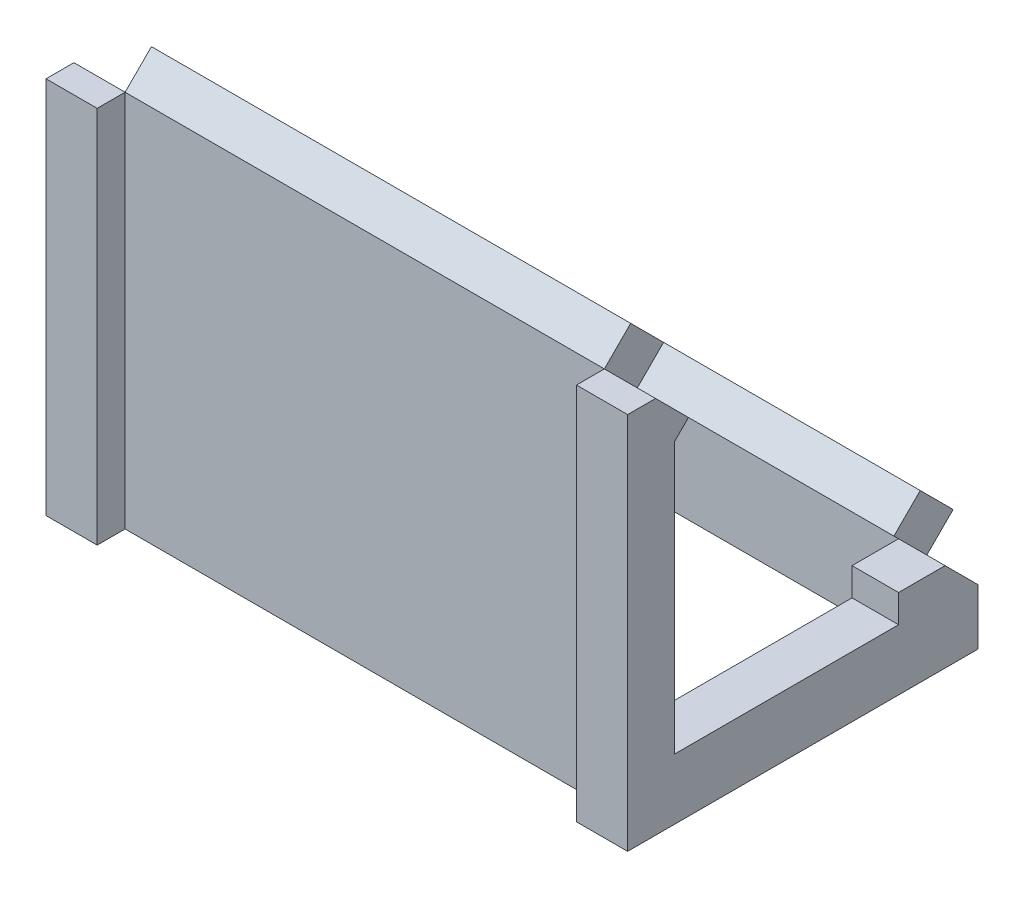
ISO-10303-21;
HEADER;
FILE_DESCRIPTION(('STEP AP214'),'2;1');
FILE_NAME('part.step','',(''),(''),'','','');
FILE_SCHEMA(('AUTOMOTIVE_DESIGN { 1 0 10303 214 1 1 1 1 }'));
ENDSEC;
DATA;
#1=APPLICATION_CONTEXT('core data for automotive mechanical design processes');
#2=APPLICATION_PROTOCOL_DEFINITION('international standard','automotive_design',2000,#1);
#3=PRODUCT_CONTEXT('',#1,'mechanical');
#4=PRODUCT('Part','Part','',(#3));
#5=PRODUCT_RELATED_PRODUCT_CATEGORY('part','',(#4));
#6=PRODUCT_DEFINITION_FORMATION('','',#4);
#7=PRODUCT_DEFINITION_CONTEXT('part definition',#1,'design');
#8=PRODUCT_DEFINITION('design','',#6,#7);
#9=PRODUCT_DEFINITION_SHAPE('','',#8);
#10=(LENGTH_UNIT() NAMED_UNIT(*) SI_UNIT(.MILLI.,.METRE.));
#11=(NAMED_UNIT(*) PLANE_ANGLE_UNIT() SI_UNIT($,.RADIAN.));
#12=(NAMED_UNIT(*) SI_UNIT($,.STERADIAN.) SOLID_ANGLE_UNIT());
#13=UNCERTAINTY_MEASURE_WITH_UNIT(LENGTH_MEASURE(1.E-05),#10,'distance_accuracy_value','');
#14=(GEOMETRIC_REPRESENTATION_CONTEXT(3) GLOBAL_UNCERTAINTY_ASSIGNED_CONTEXT((#13)) GLOBAL_UNIT_ASSIGNED_CONTEXT((#10,
#11,#12)) REPRESENTATION_CONTEXT('',''));
#15=CARTESIAN_POINT('',(0.,0.,0.));
#16=DIRECTION('',(0.,0.,1.));
#17=DIRECTION('',(1.,0.,0.));
#18=AXIS2_PLACEMENT_3D('',#15,#16,#17);
#19=CARTESIAN_POINT('',(0.,12.7279220613579,-67.8822509939089));
#20=DIRECTION('',(0.,-0.707106781186544,-0.707106781186552));
#21=DIRECTION('',(0.,0.707106781186552,-0.707106781186544));
#22=AXIS2_PLACEMENT_3D('',#19,#20,#21);
#23=PLANE('',#22);
#24=DIRECTION('',(0.,-0.70710678118655,0.707106781186545));
#25=VECTOR('',#24,1.);
#26=CARTESIAN_POINT('',(-114.,12.7279220613579,-67.8822509939089));
#27=LINE('',#26,#25);
#28=CARTESIAN_POINT('',(-114.,12.7279220613579,-67.8822509939089));
#29=VERTEX_POINT('',#28);
#30=CARTESIAN_POINT('',(-114.,7.07106781186547,-62.2253967444165));
#31=VERTEX_POINT('',#30);
#32=EDGE_CURVE('E470',#29,#31,#27,.T.);
#33=ORIENTED_EDGE('',*,*,#32,.T.);
#34=DIRECTION('',(1.,0.,0.));
#35=VECTOR('',#34,1.);
#36=CARTESIAN_POINT('',(0.,7.07106781186546,-62.2253967444165));
#37=LINE('',#36,#35);
#38=CARTESIAN_POINT('',(-11.,7.07106781186547,-62.2253967444165));
#39=VERTEX_POINT('',#38);
#40=EDGE_CURVE('E305',#31,#39,#37,.T.);
#41=ORIENTED_EDGE('',*,*,#40,.T.);
#42=DIRECTION('',(0.,-0.70710678118655,0.707106781186545));
#43=VECTOR('',#42,1.);
#44=CARTESIAN_POINT('',(-11.,12.7279220613579,-67.8822509939089));
#45=LINE('',#44,#43);
#46=CARTESIAN_POINT('',(-11.,12.7279220613579,-67.8822509939089));
#47=VERTEX_POINT('',#46);
#48=EDGE_CURVE('E443',#47,#39,#45,.T.);
#49=ORIENTED_EDGE('',*,*,#48,.F.);
#50=DIRECTION('',(1.,0.,0.));
#51=VECTOR('',#50,1.);
#52=CARTESIAN_POINT('',(0.,12.7279220613579,-67.8822509939089));
#53=LINE('',#52,#51);
#54=EDGE_CURVE('E300',#29,#47,#53,.T.);
#55=ORIENTED_EDGE('',*,*,#54,.F.);
#56=EDGE_LOOP('',(#33,#41,#49,#55));
#57=FACE_BOUND('',#56,.T.);
#58=ADVANCED_FACE('F41',(#57),#23,.F.);
#59=CARTESIAN_POINT('',(0.,5.65685424949243,-74.9533188057744));
#60=DIRECTION('',(0.,0.707106781186544,0.707106781186552));
#61=DIRECTION('',(0.,-0.707106781186552,0.707106781186544));
#62=AXIS2_PLACEMENT_3D('',#59,#60,#61);
#63=PLANE('',#62);
#64=DIRECTION('',(0.,0.707106781186552,-0.707106781186543));
#65=VECTOR('',#64,1.);
#66=CARTESIAN_POINT('',(-114.,0.,-69.2964645562821));
#67=LINE('',#66,#65);
#68=CARTESIAN_POINT('',(-114.,0.,-69.2964645562821));
#69=VERTEX_POINT('',#68);
#70=CARTESIAN_POINT('',(-114.,5.65685424949243,-74.9533188057744));
#71=VERTEX_POINT('',#70);
#72=EDGE_CURVE('E462',#69,#71,#67,.T.);
#73=ORIENTED_EDGE('',*,*,#72,.T.);
#74=DIRECTION('',(-1.,0.,0.));
#75=VECTOR('',#74,1.);
#76=CARTESIAN_POINT('',(0.,5.65685424949243,-74.9533188057744));
#77=LINE('',#76,#75);
#78=CARTESIAN_POINT('',(-11.,5.65685424949243,-74.9533188057744));
#79=VERTEX_POINT('',#78);
#80=EDGE_CURVE('E252',#79,#71,#77,.T.);
#81=ORIENTED_EDGE('',*,*,#80,.F.);
#82=DIRECTION('',(0.,0.707106781186552,-0.707106781186543));
#83=VECTOR('',#82,1.);
#84=CARTESIAN_POINT('',(-11.,0.,-69.2964645562821));
#85=LINE('',#84,#83);
#86=CARTESIAN_POINT('',(-11.,0.,-69.2964645562821));
#87=VERTEX_POINT('',#86);
#88=EDGE_CURVE('E66',#87,#79,#85,.T.);
#89=ORIENTED_EDGE('',*,*,#88,.F.);
#90=DIRECTION('',(-1.,0.,0.));
#91=VECTOR('',#90,1.);
#92=CARTESIAN_POINT('',(0.,0.,-69.2964645562821));
#93=LINE('',#92,#91);
#94=EDGE_CURVE('E296',#87,#69,#93,.T.);
#95=ORIENTED_EDGE('',*,*,#94,.T.);
#96=EDGE_LOOP('',(#73,#81,#89,#95));
#97=FACE_BOUND('',#96,.T.);
#98=ADVANCED_FACE('F662',(#97),#63,.F.);
#99=CARTESIAN_POINT('',(0.,40.3050865276335,-40.305086527633));
#100=DIRECTION('',(0.,0.707106781186551,-0.707106781186544));
#101=DIRECTION('',(0.,0.707106781186544,0.707106781186551));
#102=AXIS2_PLACEMENT_3D('',#99,#100,#101);
#103=PLANE('',#102);
#104=ORIENTED_EDGE('',*,*,#80,.T.);
#105=DIRECTION('',(0.,0.707106781186543,0.707106781186552));
#106=VECTOR('',#105,1.);
#107=CARTESIAN_POINT('',(-114.,5.65685424949243,-74.9533188057744));
#108=LINE('',#107,#106);
#109=EDGE_CURVE('E466',#71,#29,#108,.T.);
#110=ORIENTED_EDGE('',*,*,#109,.T.);
#111=ORIENTED_EDGE('',*,*,#54,.T.);
#112=DIRECTION('',(0.,0.707106781186543,0.707106781186552));
#113=VECTOR('',#112,1.);
#114=CARTESIAN_POINT('',(-11.,5.65685424949243,-74.9533188057744));
#115=LINE('',#114,#113);
#116=EDGE_CURVE('E435',#79,#47,#115,.T.);
#117=ORIENTED_EDGE('',*,*,#116,.F.);
#118=EDGE_LOOP('',(#104,#110,#111,#117));
#119=FACE_BOUND('',#118,.T.);
#120=ADVANCED_FACE('F668',(#119),#103,.T.);
#121=CARTESIAN_POINT('',(0.,74.9533188057737,-5.65685424949233));
#122=DIRECTION('',(0.,-0.707106781186544,-0.707106781186552));
#123=DIRECTION('',(0.,0.707106781186552,-0.707106781186544));
#124=AXIS2_PLACEMENT_3D('',#121,#122,#123);
#125=PLANE('',#124);
#126=DIRECTION('',(0.,-0.707106781186553,0.707106781186542));
#127=VECTOR('',#126,1.);
#128=CARTESIAN_POINT('',(-114.,74.9533188057737,-5.65685424949233));
#129=LINE('',#128,#127);
#130=CARTESIAN_POINT('',(-114.,74.9533188057737,-5.65685424949233));
#131=VERTEX_POINT('',#130);
#132=CARTESIAN_POINT('',(-114.,69.2964645562813,0.));
#133=VERTEX_POINT('',#132);
#134=EDGE_CURVE('E454',#131,#133,#129,.T.);
#135=ORIENTED_EDGE('',*,*,#134,.T.);
#136=DIRECTION('',(1.,0.,0.));
#137=VECTOR('',#136,1.);
#138=CARTESIAN_POINT('',(0.,69.2964645562813,0.));
#139=LINE('',#138,#137);
#140=CARTESIAN_POINT('',(-11.,69.2964645562813,0.));
#141=VERTEX_POINT('',#140);
#142=EDGE_CURVE('E311',#133,#141,#139,.T.);
#143=ORIENTED_EDGE('',*,*,#142,.T.);
#144=DIRECTION('',(0.,-0.707106781186553,0.707106781186542));
#145=VECTOR('',#144,1.);
#146=CARTESIAN_POINT('',(-11.,74.9533188057737,-5.65685424949233));
#147=LINE('',#146,#145);
#148=CARTESIAN_POINT('',(-11.,74.9533188057737,-5.65685424949233));
#149=VERTEX_POINT('',#148);
#150=EDGE_CURVE('E428',#149,#141,#147,.T.);
#151=ORIENTED_EDGE('',*,*,#150,.F.);
#152=DIRECTION('',(1.,0.,0.));
#153=VECTOR('',#152,1.);
#154=CARTESIAN_POINT('',(0.,74.9533188057737,-5.65685424949233));
#155=LINE('',#154,#153);
#156=EDGE_CURVE('E315',#131,#149,#155,.T.);
#157=ORIENTED_EDGE('',*,*,#156,.F.);
#158=EDGE_LOOP('',(#135,#143,#151,#157));
#159=FACE_BOUND('',#158,.T.);
#160=ADVANCED_FACE('F620',(#159),#125,.F.);
#161=CARTESIAN_POINT('',(0.,40.3050865276334,-40.305086527633));
#162=DIRECTION('',(0.,0.707106781186551,-0.707106781186544));
#163=DIRECTION('',(0.,0.707106781186544,0.707106781186551));
#164=AXIS2_PLACEMENT_3D('',#161,#162,#163);
#165=PLANE('',#164);
#166=DIRECTION('',(-1.,0.,0.));
#167=VECTOR('',#166,1.);
#168=CARTESIAN_POINT('',(0.,67.8822509939082,-12.7279220613579));
#169=LINE('',#168,#167);
#170=CARTESIAN_POINT('',(-11.,67.8822509939082,-12.7279220613579));
#171=VERTEX_POINT('',#170);
#172=CARTESIAN_POINT('',(-114.,67.8822509939083,-12.7279220613579));
#173=VERTEX_POINT('',#172);
#174=EDGE_CURVE('E317',#171,#173,#169,.T.);
#175=ORIENTED_EDGE('',*,*,#174,.T.);
#176=DIRECTION('',(0.,0.707106781186543,0.707106781186551));
#177=VECTOR('',#176,1.);
#178=CARTESIAN_POINT('',(-114.,67.8822509939082,-12.7279220613579));
#179=LINE('',#178,#177);
#180=EDGE_CURVE('E58',#173,#131,#179,.T.);
#181=ORIENTED_EDGE('',*,*,#180,.T.);
#182=ORIENTED_EDGE('',*,*,#156,.T.);
#183=DIRECTION('',(0.,0.707106781186543,0.707106781186551));
#184=VECTOR('',#183,1.);
#185=CARTESIAN_POINT('',(-11.,67.8822509939082,-12.7279220613579));
#186=LINE('',#185,#184);
#187=EDGE_CURVE('E417',#171,#149,#186,.T.);
#188=ORIENTED_EDGE('',*,*,#187,.F.);
#189=EDGE_LOOP('',(#175,#181,#182,#188));
#190=FACE_BOUND('',#189,.T.);
#191=ADVANCED_FACE('F708',(#190),#165,.T.);
#192=CARTESIAN_POINT('',(0.,67.8822509939082,-12.7279220613579));
#193=DIRECTION('',(0.,0.707106781186544,0.707106781186552));
#194=DIRECTION('',(0.,-0.707106781186552,0.707106781186544));
#195=AXIS2_PLACEMENT_3D('',#192,#193,#194);
#196=PLANE('',#195);
#197=DIRECTION('',(-1.,0.,0.));
#198=VECTOR('',#197,1.);
#199=CARTESIAN_POINT('',(0.,62.2253967444159,-7.07106781186552));
#200=LINE('',#199,#198);
#201=CARTESIAN_POINT('',(-114.,62.2253967444158,-7.07106781186586));
#202=VERTEX_POINT('',#201);
#203=CARTESIAN_POINT('',(-125.,62.2253967444158,-7.07106781186586));
#204=VERTEX_POINT('',#203);
#205=EDGE_CURVE('E233',#202,#204,#200,.T.);
#206=ORIENTED_EDGE('',*,*,#205,.F.);
#207=DIRECTION('',(0.,0.707106781186574,-0.707106781186522));
#208=VECTOR('',#207,1.);
#209=CARTESIAN_POINT('',(-114.,62.2253967444158,-7.07106781186586));
#210=LINE('',#209,#208);
#211=EDGE_CURVE('E449',#202,#173,#210,.T.);
#212=ORIENTED_EDGE('',*,*,#211,.T.);
#213=ORIENTED_EDGE('',*,*,#174,.F.);
#214=DIRECTION('',(0.,0.707106781186574,-0.707106781186522));
#215=VECTOR('',#214,1.);
#216=CARTESIAN_POINT('',(-11.,62.2253967444158,-7.07106781186586));
#217=LINE('',#216,#215);
#218=CARTESIAN_POINT('',(-11.,62.2253967444158,-7.07106781186586));
#219=VERTEX_POINT('',#218);
#220=EDGE_CURVE('E421',#219,#171,#217,.T.);
#221=ORIENTED_EDGE('',*,*,#220,.F.);
#222=CARTESIAN_POINT('',(0.,62.2253967444158,-7.07106781186586));
#223=VERTEX_POINT('',#222);
#224=EDGE_CURVE('E251',#223,#219,#200,.T.);
#225=ORIENTED_EDGE('',*,*,#224,.F.);
#226=DIRECTION('',(0.,0.7071067811865,-0.707106781186595));
#227=VECTOR('',#226,1.);
#228=CARTESIAN_POINT('',(0.,59.2253967444162,-4.07106781186586));
#229=LINE('',#228,#227);
#230=CARTESIAN_POINT('',(0.,59.2253967444162,-4.07106781186586));
#231=VERTEX_POINT('',#230);
#232=EDGE_CURVE('E560',#231,#223,#229,.T.);
#233=ORIENTED_EDGE('',*,*,#232,.F.);
#234=DIRECTION('',(1.,0.,0.));
#235=VECTOR('',#234,1.);
#236=CARTESIAN_POINT('',(-125.002,59.2253967444162,-4.07106781186586));
#237=LINE('',#236,#235);
#238=CARTESIAN_POINT('',(-125.,59.2253967444162,-4.07106781186586));
#239=VERTEX_POINT('',#238);
#240=EDGE_CURVE('E236',#239,#231,#237,.T.);
#241=ORIENTED_EDGE('',*,*,#240,.F.);
#242=DIRECTION('',(0.,-0.707106781186499,0.707106781186596));
#243=VECTOR('',#242,1.);
#244=CARTESIAN_POINT('',(-125.,59.2253967444162,-4.07106781186586));
#245=LINE('',#244,#243);
#246=EDGE_CURVE('E230',#204,#239,#245,.T.);
#247=ORIENTED_EDGE('',*,*,#246,.F.);
#248=EDGE_LOOP('',(#206,#212,#213,#221,#225,#233,#241,#247));
#249=FACE_BOUND('',#248,.T.);
#250=ADVANCED_FACE('F232',(#249),#196,.F.);
#251=CARTESIAN_POINT('',(0.,-12.,-62.2253967444165));
#252=DIRECTION('',(0.,0.,-1.));
#253=DIRECTION('',(-1.,0.,0.));
#254=AXIS2_PLACEMENT_3D('',#251,#252,#253);
#255=PLANE('',#254);
#256=CARTESIAN_POINT('',(-115.,7.07106781186547,-62.2253967444165));
#257=VERTEX_POINT('',#256);
#258=EDGE_CURVE('E301',#257,#31,#37,.T.);
#259=ORIENTED_EDGE('',*,*,#258,.F.);
#260=DIRECTION('',(0.,1.,0.));
#261=VECTOR('',#260,1.);
#262=CARTESIAN_POINT('',(-115.,-12.,-62.2253967444165));
#263=LINE('',#262,#261);
#264=CARTESIAN_POINT('',(-115.,-12.,-62.2253967444165));
#265=VERTEX_POINT('',#264);
#266=EDGE_CURVE('E323',#265,#257,#263,.T.);
#267=ORIENTED_EDGE('',*,*,#266,.F.);
#268=DIRECTION('',(-1.,0.,0.));
#269=VECTOR('',#268,1.);
#270=CARTESIAN_POINT('',(0.,-12.,-62.2253967444165));
#271=LINE('',#270,#269);
#272=CARTESIAN_POINT('',(-10.,-12.,-62.2253967444165));
#273=VERTEX_POINT('',#272);
#274=EDGE_CURVE('E348',#273,#265,#271,.T.);
#275=ORIENTED_EDGE('',*,*,#274,.F.);
#276=DIRECTION('',(0.,1.,0.));
#277=VECTOR('',#276,1.);
#278=CARTESIAN_POINT('',(-10.,-12.,-62.2253967444165));
#279=LINE('',#278,#277);
#280=CARTESIAN_POINT('',(-10.,7.07106781186547,-62.2253967444165));
#281=VERTEX_POINT('',#280);
#282=EDGE_CURVE('E316',#273,#281,#279,.T.);
#283=ORIENTED_EDGE('',*,*,#282,.T.);
#284=DIRECTION('',(1.,0.,0.));
#285=VECTOR('',#284,1.);
#286=CARTESIAN_POINT('',(-11.,7.07106781186547,-62.2253967444165));
#287=LINE('',#286,#285);
#288=EDGE_CURVE('E432',#39,#281,#287,.T.);
#289=ORIENTED_EDGE('',*,*,#288,.F.);
#290=ORIENTED_EDGE('',*,*,#40,.F.);
#291=EDGE_LOOP('',(#259,#267,#275,#283,#289,#290));
#292=FACE_BOUND('',#291,.T.);
#293=ADVANCED_FACE('F715',(#292),#255,.F.);
#294=CARTESIAN_POINT('',(0.,0.,-4.07106781186586));
#295=DIRECTION('',(0.,0.,1.));
#296=DIRECTION('',(1.,0.,0.));
#297=AXIS2_PLACEMENT_3D('',#294,#295,#296);
#298=PLANE('',#297);
#299=ORIENTED_EDGE('',*,*,#240,.T.);
#300=DIRECTION('',(0.,1.,0.));
#301=VECTOR('',#300,1.);
#302=CARTESIAN_POINT('',(0.,1.07106781186547,-4.07106781186586));
#303=LINE('',#302,#301);
#304=CARTESIAN_POINT('',(0.,1.07106781186547,-4.07106781186586));
#305=VERTEX_POINT('',#304);
#306=EDGE_CURVE('E567',#305,#231,#303,.T.);
#307=ORIENTED_EDGE('',*,*,#306,.F.);
#308=DIRECTION('',(-1.,0.,0.));
#309=VECTOR('',#308,1.);
#310=CARTESIAN_POINT('',(-10.,1.07106781186547,-4.07106781186586));
#311=LINE('',#310,#309);
#312=CARTESIAN_POINT('',(-125.,1.07106781186547,-4.07106781186586));
#313=VERTEX_POINT('',#312);
#314=EDGE_CURVE('E364',#305,#313,#311,.T.);
#315=ORIENTED_EDGE('',*,*,#314,.T.);
#316=DIRECTION('',(0.,-1.,0.));
#317=VECTOR('',#316,1.);
#318=CARTESIAN_POINT('',(-125.,1.07106781186547,-4.07106781186586));
#319=LINE('',#318,#317);
#320=EDGE_CURVE('E242',#239,#313,#319,.T.);
#321=ORIENTED_EDGE('',*,*,#320,.F.);
#322=EDGE_LOOP('',(#299,#307,#315,#321));
#323=FACE_BOUND('',#322,.T.);
#324=ADVANCED_FACE('F575',(#323),#298,.F.);
#325=CARTESIAN_POINT('',(-125.,69.2964645562813,0.));
#326=DIRECTION('',(0.,0.,1.));
#327=DIRECTION('',(0.,-1.,0.));
#328=AXIS2_PLACEMENT_3D('',#325,#326,#327);
#329=PLANE('',#328);
#330=DIRECTION('',(0.,-1.,0.));
#331=VECTOR('',#330,1.);
#332=CARTESIAN_POINT('',(-114.,-12.,0.));
#333=LINE('',#332,#331);
#334=CARTESIAN_POINT('',(-114.,-12.,0.));
#335=VERTEX_POINT('',#334);
#336=EDGE_CURVE('E513',#133,#335,#333,.T.);
#337=ORIENTED_EDGE('',*,*,#336,.T.);
#338=DIRECTION('',(-1.,0.,0.));
#339=VECTOR('',#338,1.);
#340=CARTESIAN_POINT('',(0.,-12.,0.));
#341=LINE('',#340,#339);
#342=CARTESIAN_POINT('',(-11.,-12.,0.));
#343=VERTEX_POINT('',#342);
#344=EDGE_CURVE('E283',#343,#335,#341,.T.);
#345=ORIENTED_EDGE('',*,*,#344,.F.);
#346=DIRECTION('',(0.,-1.,0.));
#347=VECTOR('',#346,1.);
#348=CARTESIAN_POINT('',(-11.,-12.,0.));
#349=LINE('',#348,#347);
#350=EDGE_CURVE('E487',#141,#343,#349,.T.);
#351=ORIENTED_EDGE('',*,*,#350,.F.);
#352=ORIENTED_EDGE('',*,*,#142,.F.);
#353=EDGE_LOOP('',(#337,#345,#351,#352));
#354=FACE_BOUND('',#353,.T.);
#355=ADVANCED_FACE('F43',(#354),#329,.T.);
#356=CARTESIAN_POINT('',(-125.,0.,-69.296464556282));
#357=DIRECTION('',(0.,0.707106781186551,-0.707106781186544));
#358=DIRECTION('',(0.,0.707106781186544,0.707106781186551));
#359=AXIS2_PLACEMENT_3D('',#356,#357,#358);
#360=PLANE('',#359);
#361=CARTESIAN_POINT('',(-6.25,64.8770471738654,-4.41941738241597));
#362=DIRECTION('',(0.,0.707106781186551,-0.707106781186544));
#363=DIRECTION('',(0.,0.707106781186544,0.707106781186551));
#364=AXIS2_PLACEMENT_3D('',#361,#362,#363);
#365=CIRCLE('',#364,2.);
#366=CARTESIAN_POINT('',(-6.25,66.2912607362385,-3.00520382004286));
#367=VERTEX_POINT('',#366);
#368=EDGE_CURVE('E540',#367,#367,#365,.T.);
#369=ORIENTED_EDGE('',*,*,#368,.F.);
#370=EDGE_LOOP('',(#369));
#371=FACE_BOUND('',#370,.T.);
#372=ORIENTED_EDGE('',*,*,#224,.T.);
#373=DIRECTION('',(0.,-0.707106781186527,-0.707106781186568));
#374=VECTOR('',#373,1.);
#375=CARTESIAN_POINT('',(-11.,69.2964645562813,0.));
#376=LINE('',#375,#374);
#377=EDGE_CURVE('E424',#141,#219,#376,.T.);
#378=ORIENTED_EDGE('',*,*,#377,.F.);
#379=DIRECTION('',(1.,0.,0.));
#380=VECTOR('',#379,1.);
#381=CARTESIAN_POINT('',(-125.,69.2964645562813,0.));
#382=LINE('',#381,#380);
#383=CARTESIAN_POINT('',(0.,69.2964645562813,0.));
#384=VERTEX_POINT('',#383);
#385=EDGE_CURVE('E51',#141,#384,#382,.T.);
#386=ORIENTED_EDGE('',*,*,#385,.T.);
#387=DIRECTION('',(0.,0.707106781186544,0.707106781186551));
#388=VECTOR('',#387,1.);
#389=CARTESIAN_POINT('',(0.,0.,-69.296464556282));
#390=LINE('',#389,#388);
#391=EDGE_CURVE('E266',#223,#384,#390,.T.);
#392=ORIENTED_EDGE('',*,*,#391,.F.);
#393=EDGE_LOOP('',(#372,#378,#386,#392));
#394=FACE_BOUND('',#393,.T.);
#395=ADVANCED_FACE('F689',(#371,#394),#360,.T.);
#396=CARTESIAN_POINT('',(-6.25,4.4194173824159,-64.8770471738661));
#397=DIRECTION('',(0.,0.707106781186551,-0.707106781186544));
#398=DIRECTION('',(0.,0.707106781186544,0.707106781186551));
#399=AXIS2_PLACEMENT_3D('',#396,#397,#398);
#400=CIRCLE('',#399,2.);
#401=CARTESIAN_POINT('',(-6.25,5.83363094478898,-63.462833611493));
#402=VERTEX_POINT('',#401);
#403=EDGE_CURVE('E532',#402,#402,#400,.T.);
#404=ORIENTED_EDGE('',*,*,#403,.F.);
#405=EDGE_LOOP('',(#404));
#406=FACE_BOUND('',#405,.T.);
#407=DIRECTION('',(1.,0.,0.));
#408=VECTOR('',#407,1.);
#409=CARTESIAN_POINT('',(-125.,0.,-69.296464556282));
#410=LINE('',#409,#408);
#411=CARTESIAN_POINT('',(0.,0.,-69.296464556282));
#412=VERTEX_POINT('',#411);
#413=EDGE_CURVE('E264',#87,#412,#410,.T.);
#414=ORIENTED_EDGE('',*,*,#413,.F.);
#415=DIRECTION('',(0.,-0.707106781186544,-0.707106781186551));
#416=VECTOR('',#415,1.);
#417=CARTESIAN_POINT('',(-11.,7.07106781186547,-62.2253967444165));
#418=LINE('',#417,#416);
#419=EDGE_CURVE('E440',#39,#87,#418,.T.);
#420=ORIENTED_EDGE('',*,*,#419,.F.);
#421=ORIENTED_EDGE('',*,*,#288,.T.);
#422=DIRECTION('',(-1.,0.,0.));
#423=VECTOR('',#422,1.);
#424=CARTESIAN_POINT('',(0.,7.07106781186543,-62.2253967444165));
#425=LINE('',#424,#423);
#426=CARTESIAN_POINT('',(0.,7.07106781186547,-62.2253967444165));
#427=VERTEX_POINT('',#426);
#428=EDGE_CURVE('E289',#427,#281,#425,.T.);
#429=ORIENTED_EDGE('',*,*,#428,.F.);
#430=EDGE_CURVE('E260',#412,#427,#390,.T.);
#431=ORIENTED_EDGE('',*,*,#430,.F.);
#432=EDGE_LOOP('',(#414,#420,#421,#429,#431));
#433=FACE_BOUND('',#432,.T.);
#434=ADVANCED_FACE('F643',(#406,#433),#360,.T.);
#435=CARTESIAN_POINT('',(-118.75,4.4194173824159,-64.8770471738661));
#436=DIRECTION('',(0.,-0.707106781186551,0.707106781186544));
#437=DIRECTION('',(0.,0.707106781186544,0.707106781186551));
#438=AXIS2_PLACEMENT_3D('',#435,#436,#437);
#439=CIRCLE('',#438,2.);
#440=CARTESIAN_POINT('',(-118.75,5.83363094478898,-63.462833611493));
#441=VERTEX_POINT('',#440);
#442=EDGE_CURVE('E548',#441,#441,#439,.T.);
#443=ORIENTED_EDGE('',*,*,#442,.T.);
#444=EDGE_LOOP('',(#443));
#445=FACE_BOUND('',#444,.T.);
#446=CARTESIAN_POINT('',(-125.,7.07106781186547,-62.2253967444165));
#447=VERTEX_POINT('',#446);
#448=EDGE_CURVE('E292',#257,#447,#425,.T.);
#449=ORIENTED_EDGE('',*,*,#448,.F.);
#450=ORIENTED_EDGE('',*,*,#258,.T.);
#451=DIRECTION('',(0.,-0.707106781186544,-0.707106781186551));
#452=VECTOR('',#451,1.);
#453=CARTESIAN_POINT('',(-114.,7.07106781186547,-62.2253967444165));
#454=LINE('',#453,#452);
#455=EDGE_CURVE('E458',#31,#69,#454,.T.);
#456=ORIENTED_EDGE('',*,*,#455,.T.);
#457=CARTESIAN_POINT('',(-125.,0.,-69.296464556282));
#458=VERTEX_POINT('',#457);
#459=EDGE_CURVE('E45',#458,#69,#410,.T.);
#460=ORIENTED_EDGE('',*,*,#459,.F.);
#461=DIRECTION('',(0.,0.707106781186544,0.707106781186551));
#462=VECTOR('',#461,1.);
#463=CARTESIAN_POINT('',(-125.,0.,-69.296464556282));
#464=LINE('',#463,#462);
#465=EDGE_CURVE('E259',#458,#447,#464,.T.);
#466=ORIENTED_EDGE('',*,*,#465,.T.);
#467=EDGE_LOOP('',(#449,#450,#456,#460,#466));
#468=FACE_BOUND('',#467,.T.);
#469=ADVANCED_FACE('F687',(#445,#468),#360,.T.);
#470=CARTESIAN_POINT('',(-118.75,64.8770471738654,-4.41941738241597));
#471=DIRECTION('',(0.,-0.707106781186551,0.707106781186544));
#472=DIRECTION('',(0.,0.707106781186544,0.707106781186551));
#473=AXIS2_PLACEMENT_3D('',#470,#471,#472);
#474=CIRCLE('',#473,2.);
#475=CARTESIAN_POINT('',(-118.75,66.2912607362385,-3.00520382004286));
#476=VERTEX_POINT('',#475);
#477=EDGE_CURVE('E556',#476,#476,#474,.T.);
#478=ORIENTED_EDGE('',*,*,#477,.T.);
#479=EDGE_LOOP('',(#478));
#480=FACE_BOUND('',#479,.T.);
#481=CARTESIAN_POINT('',(-125.,69.2964645562813,0.));
#482=VERTEX_POINT('',#481);
#483=EDGE_CURVE('E11',#482,#133,#382,.T.);
#484=ORIENTED_EDGE('',*,*,#483,.T.);
#485=DIRECTION('',(0.,-0.707106781186527,-0.707106781186568));
#486=VECTOR('',#485,1.);
#487=CARTESIAN_POINT('',(-114.,69.2964645562813,0.));
#488=LINE('',#487,#486);
#489=EDGE_CURVE('E249',#133,#202,#488,.T.);
#490=ORIENTED_EDGE('',*,*,#489,.T.);
#491=ORIENTED_EDGE('',*,*,#205,.T.);
#492=EDGE_CURVE('E247',#204,#482,#464,.T.);
#493=ORIENTED_EDGE('',*,*,#492,.T.);
#494=EDGE_LOOP('',(#484,#490,#491,#493));
#495=FACE_BOUND('',#494,.T.);
#496=ADVANCED_FACE('F246',(#480,#495),#360,.T.);
#497=CARTESIAN_POINT('',(-125.,0.,0.));
#498=DIRECTION('',(1.,0.,0.));
#499=DIRECTION('',(0.,0.,-1.));
#500=AXIS2_PLACEMENT_3D('',#497,#498,#499);
#501=PLANE('',#500);
#502=ORIENTED_EDGE('',*,*,#320,.T.);
#503=DIRECTION('',(0.,0.,1.));
#504=VECTOR('',#503,1.);
#505=CARTESIAN_POINT('',(-125.,1.07106781186547,-62.2253967444165));
#506=LINE('',#505,#504);
#507=CARTESIAN_POINT('',(-125.,1.07106781186547,-52.2253967444165));
#508=VERTEX_POINT('',#507);
#509=EDGE_CURVE('E358',#508,#313,#506,.T.);
#510=ORIENTED_EDGE('',*,*,#509,.F.);
#511=DIRECTION('',(0.,-1.,0.));
#512=VECTOR('',#511,1.);
#513=CARTESIAN_POINT('',(-125.,1.07106781186547,-52.2253967444165));
#514=LINE('',#513,#512);
#515=CARTESIAN_POINT('',(-125.,7.07106781186547,-52.2253967444165));
#516=VERTEX_POINT('',#515);
#517=EDGE_CURVE('E413',#516,#508,#514,.T.);
#518=ORIENTED_EDGE('',*,*,#517,.F.);
#519=DIRECTION('',(0.,0.,-1.));
#520=VECTOR('',#519,1.);
#521=CARTESIAN_POINT('',(-125.,7.07106781186547,-52.2253967444165));
#522=LINE('',#521,#520);
#523=EDGE_CURVE('E399',#516,#447,#522,.T.);
#524=ORIENTED_EDGE('',*,*,#523,.T.);
#525=ORIENTED_EDGE('',*,*,#465,.F.);
#526=DIRECTION('',(0.,1.,0.));
#527=VECTOR('',#526,1.);
#528=CARTESIAN_POINT('',(-125.,-12.,-69.296464556282));
#529=LINE('',#528,#527);
#530=CARTESIAN_POINT('',(-125.,-12.,-69.296464556282));
#531=VERTEX_POINT('',#530);
#532=EDGE_CURVE('E269',#531,#458,#529,.T.);
#533=ORIENTED_EDGE('',*,*,#532,.F.);
#534=DIRECTION('',(0.,0.,-1.));
#535=VECTOR('',#534,1.);
#536=CARTESIAN_POINT('',(-125.,-12.,-69.296464556282));
#537=LINE('',#536,#535);
#538=CARTESIAN_POINT('',(-125.,-12.,6.));
#539=VERTEX_POINT('',#538);
#540=EDGE_CURVE('E280',#539,#531,#537,.T.);
#541=ORIENTED_EDGE('',*,*,#540,.F.);
#542=DIRECTION('',(0.,1.,0.));
#543=VECTOR('',#542,1.);
#544=CARTESIAN_POINT('',(-125.,69.2964645562813,6.));
#545=LINE('',#544,#543);
#546=CARTESIAN_POINT('',(-125.,69.2964645562813,6.));
#547=VERTEX_POINT('',#546);
#548=EDGE_CURVE('E522',#539,#547,#545,.T.);
#549=ORIENTED_EDGE('',*,*,#548,.T.);
#550=DIRECTION('',(0.,0.,-1.));
#551=VECTOR('',#550,1.);
#552=CARTESIAN_POINT('',(-125.,69.2964645562813,6.));
#553=LINE('',#552,#551);
#554=EDGE_CURVE('E256',#547,#482,#553,.T.);
#555=ORIENTED_EDGE('',*,*,#554,.T.);
#556=ORIENTED_EDGE('',*,*,#492,.F.);
#557=ORIENTED_EDGE('',*,*,#246,.T.);
#558=EDGE_LOOP('',(#502,#510,#518,#524,#525,#533,#541,#549,#555,#556,#557));
#559=FACE_BOUND('',#558,.T.);
#560=ADVANCED_FACE('F254',(#559),#501,.F.);
#561=CARTESIAN_POINT('',(0.,0.,0.));
#562=DIRECTION('',(1.,0.,0.));
#563=DIRECTION('',(0.,0.,-1.));
#564=AXIS2_PLACEMENT_3D('',#561,#562,#563);
#565=PLANE('',#564);
#566=ORIENTED_EDGE('',*,*,#232,.T.);
#567=ORIENTED_EDGE('',*,*,#391,.T.);
#568=DIRECTION('',(0.,0.,-1.));
#569=VECTOR('',#568,1.);
#570=CARTESIAN_POINT('',(0.,69.2964645562813,6.));
#571=LINE('',#570,#569);
#572=CARTESIAN_POINT('',(0.,69.2964645562813,6.));
#573=VERTEX_POINT('',#572);
#574=EDGE_CURVE('E478',#573,#384,#571,.T.);
#575=ORIENTED_EDGE('',*,*,#574,.F.);
#576=DIRECTION('',(0.,1.,0.));
#577=VECTOR('',#576,1.);
#578=CARTESIAN_POINT('',(0.,69.2964645562813,6.));
#579=LINE('',#578,#577);
#580=CARTESIAN_POINT('',(0.,-12.,6.));
#581=VERTEX_POINT('',#580);
#582=EDGE_CURVE('E495',#581,#573,#579,.T.);
#583=ORIENTED_EDGE('',*,*,#582,.F.);
#584=DIRECTION('',(0.,0.,1.));
#585=VECTOR('',#584,1.);
#586=CARTESIAN_POINT('',(0.,-12.,-69.296464556282));
#587=LINE('',#586,#585);
#588=CARTESIAN_POINT('',(0.,-12.,-69.296464556282));
#589=VERTEX_POINT('',#588);
#590=EDGE_CURVE('E287',#589,#581,#587,.T.);
#591=ORIENTED_EDGE('',*,*,#590,.F.);
#592=DIRECTION('',(0.,1.,0.));
#593=VECTOR('',#592,1.);
#594=CARTESIAN_POINT('',(0.,-12.,-69.296464556282));
#595=LINE('',#594,#593);
#596=EDGE_CURVE('E273',#589,#412,#595,.T.);
#597=ORIENTED_EDGE('',*,*,#596,.T.);
#598=ORIENTED_EDGE('',*,*,#430,.T.);
#599=DIRECTION('',(0.,0.,-1.));
#600=VECTOR('',#599,1.);
#601=CARTESIAN_POINT('',(0.,7.07106781186547,-52.2253967444165));
#602=LINE('',#601,#600);
#603=CARTESIAN_POINT('',(0.,7.07106781186547,-52.2253967444165));
#604=VERTEX_POINT('',#603);
#605=EDGE_CURVE('E373',#604,#427,#602,.T.);
#606=ORIENTED_EDGE('',*,*,#605,.F.);
#607=DIRECTION('',(0.,1.,0.));
#608=VECTOR('',#607,1.);
#609=CARTESIAN_POINT('',(0.,1.07106781186547,-52.2253967444165));
#610=LINE('',#609,#608);
#611=CARTESIAN_POINT('',(0.,1.07106781186547,-52.2253967444165));
#612=VERTEX_POINT('',#611);
#613=EDGE_CURVE('E384',#612,#604,#610,.T.);
#614=ORIENTED_EDGE('',*,*,#613,.F.);
#615=DIRECTION('',(0.,0.,-1.));
#616=VECTOR('',#615,1.);
#617=CARTESIAN_POINT('',(0.,1.07106781186547,-62.2253967444165));
#618=LINE('',#617,#616);
#619=EDGE_CURVE('E355',#305,#612,#618,.T.);
#620=ORIENTED_EDGE('',*,*,#619,.F.);
#621=ORIENTED_EDGE('',*,*,#306,.T.);
#622=EDGE_LOOP('',(#566,#567,#575,#583,#591,#597,#598,#606,#614,#620,#621));
#623=FACE_BOUND('',#622,.T.);
#624=ADVANCED_FACE('F646',(#623),#565,.T.);
#625=CARTESIAN_POINT('',(0.,-12.,-69.296464556282));
#626=DIRECTION('',(0.,0.,1.));
#627=DIRECTION('',(1.,0.,0.));
#628=AXIS2_PLACEMENT_3D('',#625,#626,#627);
#629=PLANE('',#628);
#630=ORIENTED_EDGE('',*,*,#459,.T.);
#631=ORIENTED_EDGE('',*,*,#94,.F.);
#632=ORIENTED_EDGE('',*,*,#413,.T.);
#633=ORIENTED_EDGE('',*,*,#596,.F.);
#634=DIRECTION('',(1.,0.,0.));
#635=VECTOR('',#634,1.);
#636=CARTESIAN_POINT('',(0.,-12.,-69.296464556282));
#637=LINE('',#636,#635);
#638=EDGE_CURVE('E277',#531,#589,#637,.T.);
#639=ORIENTED_EDGE('',*,*,#638,.F.);
#640=ORIENTED_EDGE('',*,*,#532,.T.);
#641=EDGE_LOOP('',(#630,#631,#632,#633,#639,#640));
#642=FACE_BOUND('',#641,.T.);
#643=ADVANCED_FACE('F601',(#642),#629,.F.);
#644=CARTESIAN_POINT('',(0.,-12.,0.));
#645=DIRECTION('',(0.,-1.,0.));
#646=DIRECTION('',(0.,0.,-1.));
#647=AXIS2_PLACEMENT_3D('',#644,#645,#646);
#648=PLANE('',#647);
#649=ORIENTED_EDGE('',*,*,#274,.T.);
#650=DIRECTION('',(0.,0.,1.));
#651=VECTOR('',#650,1.);
#652=CARTESIAN_POINT('',(-115.,-12.,0.));
#653=LINE('',#652,#651);
#654=CARTESIAN_POINT('',(-115.,-12.,-7.07106781186586));
#655=VERTEX_POINT('',#654);
#656=EDGE_CURVE('E344',#265,#655,#653,.T.);
#657=ORIENTED_EDGE('',*,*,#656,.T.);
#658=DIRECTION('',(1.,0.,0.));
#659=VECTOR('',#658,1.);
#660=CARTESIAN_POINT('',(0.,-12.,-7.07106781186586));
#661=LINE('',#660,#659);
#662=CARTESIAN_POINT('',(-10.,-12.,-7.07106781186586));
#663=VERTEX_POINT('',#662);
#664=EDGE_CURVE('E340',#655,#663,#661,.T.);
#665=ORIENTED_EDGE('',*,*,#664,.T.);
#666=DIRECTION('',(0.,0.,1.));
#667=VECTOR('',#666,1.);
#668=CARTESIAN_POINT('',(-9.99999999999999,-12.,0.));
#669=LINE('',#668,#667);
#670=EDGE_CURVE('E327',#273,#663,#669,.T.);
#671=ORIENTED_EDGE('',*,*,#670,.F.);
#672=EDGE_LOOP('',(#649,#657,#665,#671));
#673=FACE_BOUND('',#672,.T.);
#674=ORIENTED_EDGE('',*,*,#590,.T.);
#675=DIRECTION('',(1.,0.,0.));
#676=VECTOR('',#675,1.);
#677=CARTESIAN_POINT('',(0.,-12.,6.));
#678=LINE('',#677,#676);
#679=CARTESIAN_POINT('',(-11.,-12.,6.));
#680=VERTEX_POINT('',#679);
#681=EDGE_CURVE('E498',#680,#581,#678,.T.);
#682=ORIENTED_EDGE('',*,*,#681,.F.);
#683=DIRECTION('',(0.,0.,-1.));
#684=VECTOR('',#683,1.);
#685=CARTESIAN_POINT('',(-11.,-12.,6.));
#686=LINE('',#685,#684);
#687=EDGE_CURVE('E474',#680,#343,#686,.T.);
#688=ORIENTED_EDGE('',*,*,#687,.T.);
#689=ORIENTED_EDGE('',*,*,#344,.T.);
#690=DIRECTION('',(0.,0.,-1.));
#691=VECTOR('',#690,1.);
#692=CARTESIAN_POINT('',(-114.,-12.,6.));
#693=LINE('',#692,#691);
#694=CARTESIAN_POINT('',(-114.,-12.,6.));
#695=VERTEX_POINT('',#694);
#696=EDGE_CURVE('E509',#695,#335,#693,.T.);
#697=ORIENTED_EDGE('',*,*,#696,.F.);
#698=DIRECTION('',(-1.,0.,0.));
#699=VECTOR('',#698,1.);
#700=CARTESIAN_POINT('',(-125.,-12.,6.));
#701=LINE('',#700,#699);
#702=EDGE_CURVE('E512',#695,#539,#701,.T.);
#703=ORIENTED_EDGE('',*,*,#702,.T.);
#704=ORIENTED_EDGE('',*,*,#540,.T.);
#705=ORIENTED_EDGE('',*,*,#638,.T.);
#706=EDGE_LOOP('',(#674,#682,#688,#689,#697,#703,#704,#705));
#707=FACE_BOUND('',#706,.T.);
#708=ADVANCED_FACE('F606',(#673,#707),#648,.T.);
#709=CARTESIAN_POINT('',(0.,0.,-7.07106781186586));
#710=DIRECTION('',(0.,0.,1.));
#711=DIRECTION('',(1.,0.,0.));
#712=AXIS2_PLACEMENT_3D('',#709,#710,#711);
#713=PLANE('',#712);
#714=DIRECTION('',(0.,1.,0.));
#715=VECTOR('',#714,1.);
#716=CARTESIAN_POINT('',(-115.,-12.,-7.07106781186586));
#717=LINE('',#716,#715);
#718=CARTESIAN_POINT('',(-115.,1.07106781186547,-7.07106781186586));
#719=VERTEX_POINT('',#718);
#720=EDGE_CURVE('E326',#655,#719,#717,.T.);
#721=ORIENTED_EDGE('',*,*,#720,.T.);
#722=DIRECTION('',(-1.,0.,0.));
#723=VECTOR('',#722,1.);
#724=CARTESIAN_POINT('',(-10.,1.07106781186547,-7.07106781186586));
#725=LINE('',#724,#723);
#726=CARTESIAN_POINT('',(-10.,1.07106781186547,-7.07106781186586));
#727=VERTEX_POINT('',#726);
#728=EDGE_CURVE('E365',#727,#719,#725,.T.);
#729=ORIENTED_EDGE('',*,*,#728,.F.);
#730=DIRECTION('',(0.,1.,0.));
#731=VECTOR('',#730,1.);
#732=CARTESIAN_POINT('',(-10.,-12.,-7.07106781186586));
#733=LINE('',#732,#731);
#734=EDGE_CURVE('E331',#663,#727,#733,.T.);
#735=ORIENTED_EDGE('',*,*,#734,.F.);
#736=ORIENTED_EDGE('',*,*,#664,.F.);
#737=EDGE_LOOP('',(#721,#729,#735,#736));
#738=FACE_BOUND('',#737,.T.);
#739=ADVANCED_FACE('F673',(#738),#713,.F.);
#740=CARTESIAN_POINT('',(-9.99999999999999,-12.,0.));
#741=DIRECTION('',(-1.,0.,0.));
#742=DIRECTION('',(0.,0.,1.));
#743=AXIS2_PLACEMENT_3D('',#740,#741,#742);
#744=PLANE('',#743);
#745=DIRECTION('',(0.,0.,1.));
#746=VECTOR('',#745,1.);
#747=CARTESIAN_POINT('',(-10.,1.07106781186547,-62.2253967444165));
#748=LINE('',#747,#746);
#749=CARTESIAN_POINT('',(-10.,1.07106781186547,-52.2253967444165));
#750=VERTEX_POINT('',#749);
#751=EDGE_CURVE('E352',#750,#727,#748,.T.);
#752=ORIENTED_EDGE('',*,*,#751,.F.);
#753=DIRECTION('',(0.,-1.,0.));
#754=VECTOR('',#753,1.);
#755=CARTESIAN_POINT('',(-10.,1.07106781186547,-52.2253967444165));
#756=LINE('',#755,#754);
#757=CARTESIAN_POINT('',(-10.,7.07106781186547,-52.2253967444165));
#758=VERTEX_POINT('',#757);
#759=EDGE_CURVE('E391',#758,#750,#756,.T.);
#760=ORIENTED_EDGE('',*,*,#759,.F.);
#761=DIRECTION('',(0.,0.,-1.));
#762=VECTOR('',#761,1.);
#763=CARTESIAN_POINT('',(-10.,7.07106781186547,-52.2253967444165));
#764=LINE('',#763,#762);
#765=EDGE_CURVE('E377',#758,#281,#764,.T.);
#766=ORIENTED_EDGE('',*,*,#765,.T.);
#767=ORIENTED_EDGE('',*,*,#282,.F.);
#768=ORIENTED_EDGE('',*,*,#670,.T.);
#769=ORIENTED_EDGE('',*,*,#734,.T.);
#770=EDGE_LOOP('',(#752,#760,#766,#767,#768,#769));
#771=FACE_BOUND('',#770,.T.);
#772=ADVANCED_FACE('F676',(#771),#744,.T.);
#773=CARTESIAN_POINT('',(-115.,-12.,0.));
#774=DIRECTION('',(-1.,0.,0.));
#775=DIRECTION('',(0.,0.,1.));
#776=AXIS2_PLACEMENT_3D('',#773,#774,#775);
#777=PLANE('',#776);
#778=ORIENTED_EDGE('',*,*,#266,.T.);
#779=DIRECTION('',(0.,0.,-1.));
#780=VECTOR('',#779,1.);
#781=CARTESIAN_POINT('',(-115.,7.07106781186547,-52.2253967444165));
#782=LINE('',#781,#780);
#783=CARTESIAN_POINT('',(-115.,7.07106781186547,-52.2253967444165));
#784=VERTEX_POINT('',#783);
#785=EDGE_CURVE('E395',#784,#257,#782,.T.);
#786=ORIENTED_EDGE('',*,*,#785,.F.);
#787=DIRECTION('',(0.,1.,0.));
#788=VECTOR('',#787,1.);
#789=CARTESIAN_POINT('',(-115.,1.07106781186547,-52.2253967444165));
#790=LINE('',#789,#788);
#791=CARTESIAN_POINT('',(-115.,1.07106781186547,-52.2253967444165));
#792=VERTEX_POINT('',#791);
#793=EDGE_CURVE('E406',#792,#784,#790,.T.);
#794=ORIENTED_EDGE('',*,*,#793,.F.);
#795=DIRECTION('',(0.,0.,-1.));
#796=VECTOR('',#795,1.);
#797=CARTESIAN_POINT('',(-115.,1.07106781186547,-62.2253967444165));
#798=LINE('',#797,#796);
#799=EDGE_CURVE('E361',#719,#792,#798,.T.);
#800=ORIENTED_EDGE('',*,*,#799,.F.);
#801=ORIENTED_EDGE('',*,*,#720,.F.);
#802=ORIENTED_EDGE('',*,*,#656,.F.);
#803=EDGE_LOOP('',(#778,#786,#794,#800,#801,#802));
#804=FACE_BOUND('',#803,.T.);
#805=ADVANCED_FACE('F586',(#804),#777,.F.);
#806=CARTESIAN_POINT('',(-10.,1.07106781186547,-4.07106781186586));
#807=DIRECTION('',(0.,-1.,0.));
#808=DIRECTION('',(0.,0.,-1.));
#809=AXIS2_PLACEMENT_3D('',#806,#807,#808);
#810=PLANE('',#809);
#811=ORIENTED_EDGE('',*,*,#728,.T.);
#812=ORIENTED_EDGE('',*,*,#799,.T.);
#813=DIRECTION('',(1.,0.,0.));
#814=VECTOR('',#813,1.);
#815=CARTESIAN_POINT('',(-125.,1.07106781186547,-52.2253967444165));
#816=LINE('',#815,#814);
#817=EDGE_CURVE('E409',#508,#792,#816,.T.);
#818=ORIENTED_EDGE('',*,*,#817,.F.);
#819=ORIENTED_EDGE('',*,*,#509,.T.);
#820=ORIENTED_EDGE('',*,*,#314,.F.);
#821=ORIENTED_EDGE('',*,*,#619,.T.);
#822=DIRECTION('',(1.,0.,0.));
#823=VECTOR('',#822,1.);
#824=CARTESIAN_POINT('',(-10.,1.07106781186547,-52.2253967444165));
#825=LINE('',#824,#823);
#826=EDGE_CURVE('E387',#750,#612,#825,.T.);
#827=ORIENTED_EDGE('',*,*,#826,.F.);
#828=ORIENTED_EDGE('',*,*,#751,.T.);
#829=EDGE_LOOP('',(#811,#812,#818,#819,#820,#821,#827,#828));
#830=FACE_BOUND('',#829,.T.);
#831=ADVANCED_FACE('F579',(#830),#810,.F.);
#832=CARTESIAN_POINT('',(-10.,7.07106781186547,-52.2253967444165));
#833=DIRECTION('',(0.,-1.,0.));
#834=DIRECTION('',(0.,0.,-1.));
#835=AXIS2_PLACEMENT_3D('',#832,#833,#834);
#836=PLANE('',#835);
#837=ORIENTED_EDGE('',*,*,#428,.T.);
#838=ORIENTED_EDGE('',*,*,#765,.F.);
#839=DIRECTION('',(-1.,0.,0.));
#840=VECTOR('',#839,1.);
#841=CARTESIAN_POINT('',(-10.,7.07106781186547,-52.2253967444165));
#842=LINE('',#841,#840);
#843=EDGE_CURVE('E381',#604,#758,#842,.T.);
#844=ORIENTED_EDGE('',*,*,#843,.F.);
#845=ORIENTED_EDGE('',*,*,#605,.T.);
#846=EDGE_LOOP('',(#837,#838,#844,#845));
#847=FACE_BOUND('',#846,.T.);
#848=ADVANCED_FACE('F749',(#847),#836,.F.);
#849=CARTESIAN_POINT('',(0.,0.,-52.2253967444165));
#850=DIRECTION('',(0.,0.,-1.));
#851=DIRECTION('',(-1.,0.,0.));
#852=AXIS2_PLACEMENT_3D('',#849,#850,#851);
#853=PLANE('',#852);
#854=ORIENTED_EDGE('',*,*,#759,.T.);
#855=ORIENTED_EDGE('',*,*,#826,.T.);
#856=ORIENTED_EDGE('',*,*,#613,.T.);
#857=ORIENTED_EDGE('',*,*,#843,.T.);
#858=EDGE_LOOP('',(#854,#855,#856,#857));
#859=FACE_BOUND('',#858,.T.);
#860=ADVANCED_FACE('F739',(#859),#853,.F.);
#861=CARTESIAN_POINT('',(-125.,7.07106781186547,-52.2253967444165));
#862=DIRECTION('',(0.,-1.,0.));
#863=DIRECTION('',(0.,0.,-1.));
#864=AXIS2_PLACEMENT_3D('',#861,#862,#863);
#865=PLANE('',#864);
#866=ORIENTED_EDGE('',*,*,#448,.T.);
#867=ORIENTED_EDGE('',*,*,#523,.F.);
#868=DIRECTION('',(-1.,0.,0.));
#869=VECTOR('',#868,1.);
#870=CARTESIAN_POINT('',(-125.,7.07106781186547,-52.2253967444165));
#871=LINE('',#870,#869);
#872=EDGE_CURVE('E403',#784,#516,#871,.T.);
#873=ORIENTED_EDGE('',*,*,#872,.F.);
#874=ORIENTED_EDGE('',*,*,#785,.T.);
#875=EDGE_LOOP('',(#866,#867,#873,#874));
#876=FACE_BOUND('',#875,.T.);
#877=ADVANCED_FACE('F594',(#876),#865,.F.);
#878=CARTESIAN_POINT('',(0.,0.,-52.2253967444165));
#879=DIRECTION('',(0.,0.,-1.));
#880=DIRECTION('',(-1.,0.,0.));
#881=AXIS2_PLACEMENT_3D('',#878,#879,#880);
#882=PLANE('',#881);
#883=ORIENTED_EDGE('',*,*,#517,.T.);
#884=ORIENTED_EDGE('',*,*,#817,.T.);
#885=ORIENTED_EDGE('',*,*,#793,.T.);
#886=ORIENTED_EDGE('',*,*,#872,.T.);
#887=EDGE_LOOP('',(#883,#884,#885,#886));
#888=FACE_BOUND('',#887,.T.);
#889=ADVANCED_FACE('F583',(#888),#882,.F.);
#890=CARTESIAN_POINT('',(-11.,0.,0.));
#891=DIRECTION('',(1.,0.,0.));
#892=DIRECTION('',(0.,0.,-1.));
#893=AXIS2_PLACEMENT_3D('',#890,#891,#892);
#894=PLANE('',#893);
#895=ORIENTED_EDGE('',*,*,#150,.T.);
#896=ORIENTED_EDGE('',*,*,#377,.T.);
#897=ORIENTED_EDGE('',*,*,#220,.T.);
#898=ORIENTED_EDGE('',*,*,#187,.T.);
#899=EDGE_LOOP('',(#895,#896,#897,#898));
#900=FACE_BOUND('',#899,.T.);
#901=ADVANCED_FACE('F704',(#900),#894,.T.);
#902=CARTESIAN_POINT('',(-11.,0.,0.));
#903=DIRECTION('',(1.,0.,0.));
#904=DIRECTION('',(0.,0.,-1.));
#905=AXIS2_PLACEMENT_3D('',#902,#903,#904);
#906=PLANE('',#905);
#907=ORIENTED_EDGE('',*,*,#48,.T.);
#908=ORIENTED_EDGE('',*,*,#419,.T.);
#909=ORIENTED_EDGE('',*,*,#88,.T.);
#910=ORIENTED_EDGE('',*,*,#116,.T.);
#911=EDGE_LOOP('',(#907,#908,#909,#910));
#912=FACE_BOUND('',#911,.T.);
#913=ADVANCED_FACE('F947',(#912),#906,.T.);
#914=CARTESIAN_POINT('',(-114.,0.,0.));
#915=DIRECTION('',(-1.,0.,0.));
#916=DIRECTION('',(0.,0.,-1.));
#917=AXIS2_PLACEMENT_3D('',#914,#915,#916);
#918=PLANE('',#917);
#919=ORIENTED_EDGE('',*,*,#134,.F.);
#920=ORIENTED_EDGE('',*,*,#180,.F.);
#921=ORIENTED_EDGE('',*,*,#211,.F.);
#922=ORIENTED_EDGE('',*,*,#489,.F.);
#923=EDGE_LOOP('',(#919,#920,#921,#922));
#924=FACE_BOUND('',#923,.T.);
#925=ADVANCED_FACE('F616',(#924),#918,.T.);
#926=CARTESIAN_POINT('',(-114.,0.,0.));
#927=DIRECTION('',(-1.,0.,0.));
#928=DIRECTION('',(0.,0.,-1.));
#929=AXIS2_PLACEMENT_3D('',#926,#927,#928);
#930=PLANE('',#929);
#931=ORIENTED_EDGE('',*,*,#32,.F.);
#932=ORIENTED_EDGE('',*,*,#109,.F.);
#933=ORIENTED_EDGE('',*,*,#72,.F.);
#934=ORIENTED_EDGE('',*,*,#455,.F.);
#935=EDGE_LOOP('',(#931,#932,#933,#934));
#936=FACE_BOUND('',#935,.T.);
#937=ADVANCED_FACE('F728',(#936),#930,.T.);
#938=CARTESIAN_POINT('',(0.,0.,6.));
#939=DIRECTION('',(0.,0.,-1.));
#940=DIRECTION('',(-1.,0.,0.));
#941=AXIS2_PLACEMENT_3D('',#938,#939,#940);
#942=PLANE('',#941);
#943=DIRECTION('',(0.,-1.,0.));
#944=VECTOR('',#943,1.);
#945=CARTESIAN_POINT('',(-11.,-12.,6.));
#946=LINE('',#945,#944);
#947=CARTESIAN_POINT('',(-11.,69.2964645562813,6.));
#948=VERTEX_POINT('',#947);
#949=EDGE_CURVE('E491',#948,#680,#946,.T.);
#950=ORIENTED_EDGE('',*,*,#949,.T.);
#951=ORIENTED_EDGE('',*,*,#681,.T.);
#952=ORIENTED_EDGE('',*,*,#582,.T.);
#953=DIRECTION('',(-1.,0.,0.));
#954=VECTOR('',#953,1.);
#955=CARTESIAN_POINT('',(-11.,69.2964645562813,6.));
#956=LINE('',#955,#954);
#957=EDGE_CURVE('E486',#573,#948,#956,.T.);
#958=ORIENTED_EDGE('',*,*,#957,.T.);
#959=EDGE_LOOP('',(#950,#951,#952,#958));
#960=FACE_BOUND('',#959,.T.);
#961=ADVANCED_FACE('F649',(#960),#942,.F.);
#962=CARTESIAN_POINT('',(-11.,69.2964645562813,6.));
#963=DIRECTION('',(0.,-1.,0.));
#964=DIRECTION('',(0.,0.,-1.));
#965=AXIS2_PLACEMENT_3D('',#962,#963,#964);
#966=PLANE('',#965);
#967=ORIENTED_EDGE('',*,*,#385,.F.);
#968=DIRECTION('',(0.,0.,-1.));
#969=VECTOR('',#968,1.);
#970=CARTESIAN_POINT('',(-11.,69.2964645562813,6.));
#971=LINE('',#970,#969);
#972=EDGE_CURVE('E482',#948,#141,#971,.T.);
#973=ORIENTED_EDGE('',*,*,#972,.F.);
#974=ORIENTED_EDGE('',*,*,#957,.F.);
#975=ORIENTED_EDGE('',*,*,#574,.T.);
#976=EDGE_LOOP('',(#967,#973,#974,#975));
#977=FACE_BOUND('',#976,.T.);
#978=ADVANCED_FACE('F632',(#977),#966,.F.);
#979=CARTESIAN_POINT('',(-11.,-12.,6.));
#980=DIRECTION('',(1.,0.,0.));
#981=DIRECTION('',(0.,0.,-1.));
#982=AXIS2_PLACEMENT_3D('',#979,#980,#981);
#983=PLANE('',#982);
#984=ORIENTED_EDGE('',*,*,#350,.T.);
#985=ORIENTED_EDGE('',*,*,#687,.F.);
#986=ORIENTED_EDGE('',*,*,#949,.F.);
#987=ORIENTED_EDGE('',*,*,#972,.T.);
#988=EDGE_LOOP('',(#984,#985,#986,#987));
#989=FACE_BOUND('',#988,.T.);
#990=ADVANCED_FACE('F626',(#989),#983,.F.);
#991=CARTESIAN_POINT('',(-114.,-12.,6.));
#992=DIRECTION('',(1.,0.,0.));
#993=DIRECTION('',(0.,0.,-1.));
#994=AXIS2_PLACEMENT_3D('',#991,#992,#993);
#995=PLANE('',#994);
#996=ORIENTED_EDGE('',*,*,#336,.F.);
#997=DIRECTION('',(0.,0.,-1.));
#998=VECTOR('',#997,1.);
#999=CARTESIAN_POINT('',(-114.,69.2964645562813,6.));
#1000=LINE('',#999,#998);
#1001=CARTESIAN_POINT('',(-114.,69.2964645562813,6.));
#1002=VERTEX_POINT('',#1001);
#1003=EDGE_CURVE('E492',#1002,#133,#1000,.T.);
#1004=ORIENTED_EDGE('',*,*,#1003,.F.);
#1005=DIRECTION('',(0.,-1.,0.));
#1006=VECTOR('',#1005,1.);
#1007=CARTESIAN_POINT('',(-114.,-12.,6.));
#1008=LINE('',#1007,#1006);
#1009=EDGE_CURVE('E517',#1002,#695,#1008,.T.);
#1010=ORIENTED_EDGE('',*,*,#1009,.T.);
#1011=ORIENTED_EDGE('',*,*,#696,.T.);
#1012=EDGE_LOOP('',(#996,#1004,#1010,#1011));
#1013=FACE_BOUND('',#1012,.T.);
#1014=ADVANCED_FACE('F651',(#1013),#995,.T.);
#1015=CARTESIAN_POINT('',(-114.,69.2964645562813,6.));
#1016=DIRECTION('',(0.,1.,0.));
#1017=DIRECTION('',(0.,0.,1.));
#1018=AXIS2_PLACEMENT_3D('',#1015,#1016,#1017);
#1019=PLANE('',#1018);
#1020=ORIENTED_EDGE('',*,*,#483,.F.);
#1021=ORIENTED_EDGE('',*,*,#554,.F.);
#1022=DIRECTION('',(1.,0.,0.));
#1023=VECTOR('',#1022,1.);
#1024=CARTESIAN_POINT('',(-114.,69.2964645562813,6.));
#1025=LINE('',#1024,#1023);
#1026=EDGE_CURVE('E525',#547,#1002,#1025,.T.);
#1027=ORIENTED_EDGE('',*,*,#1026,.T.);
#1028=ORIENTED_EDGE('',*,*,#1003,.T.);
#1029=EDGE_LOOP('',(#1020,#1021,#1027,#1028));
#1030=FACE_BOUND('',#1029,.T.);
#1031=ADVANCED_FACE('F614',(#1030),#1019,.T.);
#1032=CARTESIAN_POINT('',(-125.,0.,6.));
#1033=DIRECTION('',(0.,0.,-1.));
#1034=DIRECTION('',(1.,0.,0.));
#1035=AXIS2_PLACEMENT_3D('',#1032,#1033,#1034);
#1036=PLANE('',#1035);
#1037=ORIENTED_EDGE('',*,*,#1009,.F.);
#1038=ORIENTED_EDGE('',*,*,#1026,.F.);
#1039=ORIENTED_EDGE('',*,*,#548,.F.);
#1040=ORIENTED_EDGE('',*,*,#702,.F.);
#1041=EDGE_LOOP('',(#1037,#1038,#1039,#1040));
#1042=FACE_BOUND('',#1041,.T.);
#1043=ADVANCED_FACE('F612',(#1042),#1036,.F.);
#1044=CARTESIAN_POINT('',(-6.25,0.176776695296588,-60.6344064867468));
#1045=DIRECTION('',(0.,0.707106781186551,-0.707106781186544));
#1046=DIRECTION('',(0.,0.707106781186544,0.707106781186551));
#1047=AXIS2_PLACEMENT_3D('',#1044,#1045,#1046);
#1048=CYLINDRICAL_SURFACE('',#1047,2.);
#1049=CARTESIAN_POINT('',(-6.25,0.176776695296588,-60.6344064867468));
#1050=DIRECTION('',(0.,0.707106781186551,-0.707106781186544));
#1051=DIRECTION('',(0.,0.707106781186544,0.707106781186551));
#1052=AXIS2_PLACEMENT_3D('',#1049,#1050,#1051);
#1053=CIRCLE('',#1052,2.);
#1054=CARTESIAN_POINT('',(-6.25,1.59099025766968,-59.2201929243737));
#1055=VERTEX_POINT('',#1054);
#1056=EDGE_CURVE('E518',#1055,#1055,#1053,.T.);
#1057=ORIENTED_EDGE('',*,*,#1056,.F.);
#1058=EDGE_LOOP('',(#1057));
#1059=FACE_BOUND('',#1058,.T.);
#1060=ORIENTED_EDGE('',*,*,#403,.T.);
#1061=EDGE_LOOP('',(#1060));
#1062=FACE_BOUND('',#1061,.T.);
#1063=ADVANCED_FACE('F778',(#1059,#1062),#1048,.F.);
#1064=CARTESIAN_POINT('',(0.,30.4055915910217,-30.4055915910214));
#1065=DIRECTION('',(0.,0.707106781186552,-0.707106781186544));
#1066=DIRECTION('',(0.,0.707106781186544,0.707106781186552));
#1067=AXIS2_PLACEMENT_3D('',#1064,#1065,#1066);
#1068=PLANE('',#1067);
#1069=ORIENTED_EDGE('',*,*,#1056,.T.);
#1070=EDGE_LOOP('',(#1069));
#1071=FACE_BOUND('',#1070,.T.);
#1072=ADVANCED_FACE('F775',(#1071),#1068,.T.);
#1073=CARTESIAN_POINT('',(-6.25,60.6344064867461,-0.176776695296702));
#1074=DIRECTION('',(0.,0.707106781186551,-0.707106781186544));
#1075=DIRECTION('',(0.,0.707106781186544,0.707106781186551));
#1076=AXIS2_PLACEMENT_3D('',#1073,#1074,#1075);
#1077=CYLINDRICAL_SURFACE('',#1076,2.);
#1078=CARTESIAN_POINT('',(-6.25,60.6344064867461,-0.176776695296702));
#1079=DIRECTION('',(0.,0.707106781186551,-0.707106781186544));
#1080=DIRECTION('',(0.,0.707106781186544,0.707106781186551));
#1081=AXIS2_PLACEMENT_3D('',#1078,#1079,#1080);
#1082=CIRCLE('',#1081,2.);
#1083=CARTESIAN_POINT('',(-6.25,62.0486200491192,1.2374368670764));
#1084=VERTEX_POINT('',#1083);
#1085=EDGE_CURVE('E536',#1084,#1084,#1082,.T.);
#1086=ORIENTED_EDGE('',*,*,#1085,.F.);
#1087=EDGE_LOOP('',(#1086));
#1088=FACE_BOUND('',#1087,.T.);
#1089=ORIENTED_EDGE('',*,*,#368,.T.);
#1090=EDGE_LOOP('',(#1089));
#1091=FACE_BOUND('',#1090,.T.);
#1092=ADVANCED_FACE('F769',(#1088,#1091),#1077,.F.);
#1093=CARTESIAN_POINT('',(0.,30.4055915910217,-30.4055915910214));
#1094=DIRECTION('',(0.,0.707106781186552,-0.707106781186543));
#1095=DIRECTION('',(0.,0.707106781186543,0.707106781186552));
#1096=AXIS2_PLACEMENT_3D('',#1093,#1094,#1095);
#1097=PLANE('',#1096);
#1098=ORIENTED_EDGE('',*,*,#1085,.T.);
#1099=EDGE_LOOP('',(#1098));
#1100=FACE_BOUND('',#1099,.T.);
#1101=ADVANCED_FACE('F765',(#1100),#1097,.T.);
#1102=CARTESIAN_POINT('',(-118.75,0.176776695296588,-60.6344064867468));
#1103=DIRECTION('',(0.,0.707106781186551,-0.707106781186544));
#1104=DIRECTION('',(0.,0.707106781186544,0.707106781186551));
#1105=AXIS2_PLACEMENT_3D('',#1102,#1103,#1104);
#1106=CYLINDRICAL_SURFACE('',#1105,2.);
#1107=CARTESIAN_POINT('',(-118.75,0.176776695296588,-60.6344064867468));
#1108=DIRECTION('',(0.,-0.707106781186551,0.707106781186544));
#1109=DIRECTION('',(0.,0.707106781186544,0.707106781186551));
#1110=AXIS2_PLACEMENT_3D('',#1107,#1108,#1109);
#1111=CIRCLE('',#1110,2.);
#1112=CARTESIAN_POINT('',(-118.75,1.59099025766968,-59.2201929243737));
#1113=VERTEX_POINT('',#1112);
#1114=EDGE_CURVE('E544',#1113,#1113,#1111,.T.);
#1115=ORIENTED_EDGE('',*,*,#1114,.T.);
#1116=EDGE_LOOP('',(#1115));
#1117=FACE_BOUND('',#1116,.T.);
#1118=ORIENTED_EDGE('',*,*,#442,.F.);
#1119=EDGE_LOOP('',(#1118));
#1120=FACE_BOUND('',#1119,.T.);
#1121=ADVANCED_FACE('F768',(#1117,#1120),#1106,.F.);
#1122=CARTESIAN_POINT('',(-125.,30.4055915910217,-30.4055915910214));
#1123=DIRECTION('',(0.,0.707106781186552,-0.707106781186544));
#1124=DIRECTION('',(0.,0.707106781186544,0.707106781186552));
#1125=AXIS2_PLACEMENT_3D('',#1122,#1123,#1124);
#1126=PLANE('',#1125);
#1127=ORIENTED_EDGE('',*,*,#1114,.F.);
#1128=EDGE_LOOP('',(#1127));
#1129=FACE_BOUND('',#1128,.T.);
#1130=ADVANCED_FACE('F771',(#1129),#1126,.T.);
#1131=CARTESIAN_POINT('',(-118.75,60.6344064867461,-0.176776695296702));
#1132=DIRECTION('',(0.,0.707106781186551,-0.707106781186544));
#1133=DIRECTION('',(0.,0.707106781186544,0.707106781186551));
#1134=AXIS2_PLACEMENT_3D('',#1131,#1132,#1133);
#1135=CYLINDRICAL_SURFACE('',#1134,2.);
#1136=CARTESIAN_POINT('',(-118.75,60.6344064867461,-0.176776695296702));
#1137=DIRECTION('',(0.,-0.707106781186551,0.707106781186544));
#1138=DIRECTION('',(0.,0.707106781186544,0.707106781186551));
#1139=AXIS2_PLACEMENT_3D('',#1136,#1137,#1138);
#1140=CIRCLE('',#1139,2.);
#1141=CARTESIAN_POINT('',(-118.75,62.0486200491192,1.2374368670764));
#1142=VERTEX_POINT('',#1141);
#1143=EDGE_CURVE('E552',#1142,#1142,#1140,.T.);
#1144=ORIENTED_EDGE('',*,*,#1143,.T.);
#1145=EDGE_LOOP('',(#1144));
#1146=FACE_BOUND('',#1145,.T.);
#1147=ORIENTED_EDGE('',*,*,#477,.F.);
#1148=EDGE_LOOP('',(#1147));
#1149=FACE_BOUND('',#1148,.T.);
#1150=ADVANCED_FACE('F763',(#1146,#1149),#1135,.F.);
#1151=CARTESIAN_POINT('',(-125.,30.4055915910217,-30.4055915910214));
#1152=DIRECTION('',(0.,0.707106781186552,-0.707106781186543));
#1153=DIRECTION('',(0.,0.707106781186543,0.707106781186552));
#1154=AXIS2_PLACEMENT_3D('',#1151,#1152,#1153);
#1155=PLANE('',#1154);
#1156=ORIENTED_EDGE('',*,*,#1143,.F.);
#1157=EDGE_LOOP('',(#1156));
#1158=FACE_BOUND('',#1157,.T.);
#1159=ADVANCED_FACE('F760',(#1158),#1155,.T.);
#1160=CLOSED_SHELL('',(#58,#98,#120,#160,#191,#250,#293,#324,#355,#395,#434,#469,#496,#560,#624,
#643,#708,#739,#772,#805,#831,#848,#860,#877,#889,#901,#913,#925,#937,#961,#978,#990,#1014,
#1031,#1043,#1063,#1072,#1092,#1101,#1121,#1130,#1150,#1159));
#1161=MANIFOLD_SOLID_BREP('B2',#1160);
#1162=ADVANCED_BREP_SHAPE_REPRESENTATION('',(#18,#1161),#14);
#1163=SHAPE_DEFINITION_REPRESENTATION(#9,#1162);
ENDSEC;
END-ISO-10303-21;
